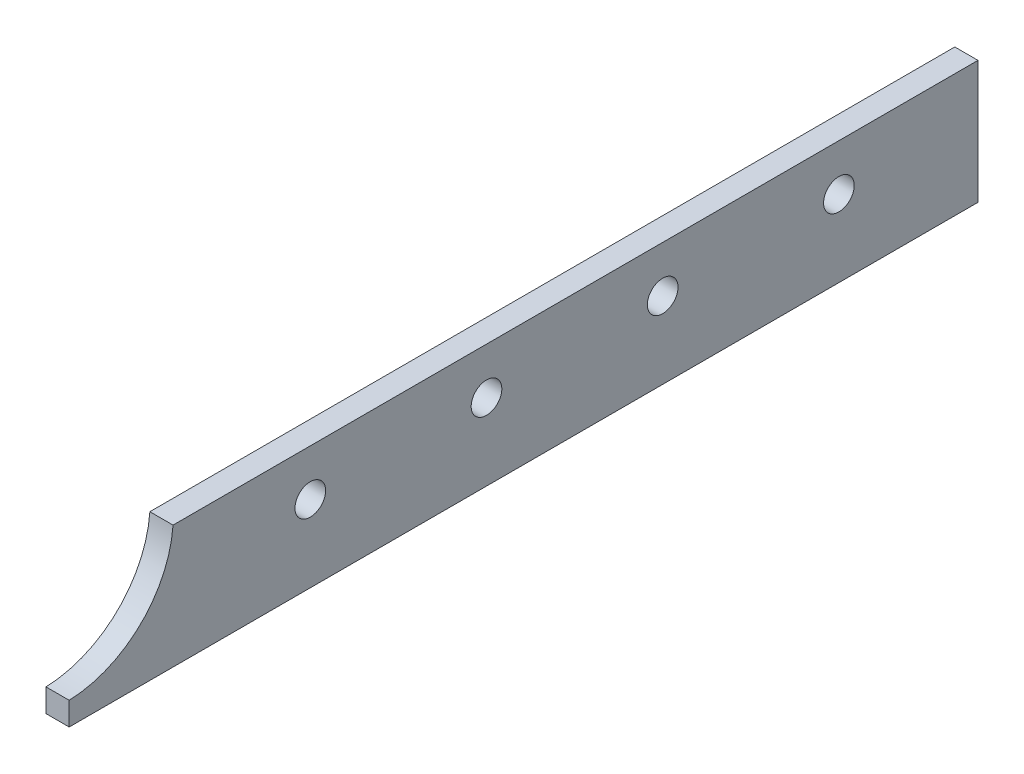
ISO-10303-21;
HEADER;
FILE_DESCRIPTION(('STEP AP214'),'2;1');
FILE_NAME('part.step','',(''),(''),'','','');
FILE_SCHEMA(('AUTOMOTIVE_DESIGN { 1 0 10303 214 1 1 1 1 }'));
ENDSEC;
DATA;
#1=APPLICATION_CONTEXT('core data for automotive mechanical design processes');
#2=APPLICATION_PROTOCOL_DEFINITION('international standard','automotive_design',2000,#1);
#3=PRODUCT_CONTEXT('',#1,'mechanical');
#4=PRODUCT('Part','Part','',(#3));
#5=PRODUCT_RELATED_PRODUCT_CATEGORY('part','',(#4));
#6=PRODUCT_DEFINITION_FORMATION('','',#4);
#7=PRODUCT_DEFINITION_CONTEXT('part definition',#1,'design');
#8=PRODUCT_DEFINITION('design','',#6,#7);
#9=PRODUCT_DEFINITION_SHAPE('','',#8);
#10=(LENGTH_UNIT() NAMED_UNIT(*) SI_UNIT(.MILLI.,.METRE.));
#11=(NAMED_UNIT(*) PLANE_ANGLE_UNIT() SI_UNIT($,.RADIAN.));
#12=(NAMED_UNIT(*) SI_UNIT($,.STERADIAN.) SOLID_ANGLE_UNIT());
#13=UNCERTAINTY_MEASURE_WITH_UNIT(LENGTH_MEASURE(1.E-05),#10,'distance_accuracy_value','');
#14=(GEOMETRIC_REPRESENTATION_CONTEXT(3) GLOBAL_UNCERTAINTY_ASSIGNED_CONTEXT((#13)) GLOBAL_UNIT_ASSIGNED_CONTEXT((#10,
#11,#12)) REPRESENTATION_CONTEXT('',''));
#15=CARTESIAN_POINT('',(0.,0.,0.));
#16=DIRECTION('',(0.,0.,1.));
#17=DIRECTION('',(1.,0.,0.));
#18=AXIS2_PLACEMENT_3D('',#15,#16,#17);
#19=CARTESIAN_POINT('',(3.175,-8.4201,-62.23));
#20=DIRECTION('',(0.,0.,1.));
#21=DIRECTION('',(1.,0.,0.));
#22=AXIS2_PLACEMENT_3D('',#19,#20,#21);
#23=PLANE('',#22);
#24=DIRECTION('',(0.,1.,0.));
#25=VECTOR('',#24,1.);
#26=CARTESIAN_POINT('',(0.,-8.4201,-62.23));
#27=LINE('',#26,#25);
#28=CARTESIAN_POINT('',(0.,-8.4201,-62.23));
#29=VERTEX_POINT('',#28);
#30=CARTESIAN_POINT('',(0.,8.4201,-62.23));
#31=VERTEX_POINT('',#30);
#32=EDGE_CURVE('E113',#29,#31,#27,.T.);
#33=ORIENTED_EDGE('',*,*,#32,.T.);
#34=DIRECTION('',(-1.,0.,0.));
#35=VECTOR('',#34,1.);
#36=CARTESIAN_POINT('',(3.175,8.4201,-62.23));
#37=LINE('',#36,#35);
#38=CARTESIAN_POINT('',(3.175,8.4201,-62.23));
#39=VERTEX_POINT('',#38);
#40=EDGE_CURVE('E11',#39,#31,#37,.T.);
#41=ORIENTED_EDGE('',*,*,#40,.F.);
#42=DIRECTION('',(0.,1.,0.));
#43=VECTOR('',#42,1.);
#44=CARTESIAN_POINT('',(3.175,-8.4201,-62.23));
#45=LINE('',#44,#43);
#46=CARTESIAN_POINT('',(3.175,-8.4201,-62.23));
#47=VERTEX_POINT('',#46);
#48=EDGE_CURVE('E122',#47,#39,#45,.T.);
#49=ORIENTED_EDGE('',*,*,#48,.F.);
#50=DIRECTION('',(-1.,0.,0.));
#51=VECTOR('',#50,1.);
#52=CARTESIAN_POINT('',(3.175,-8.4201,-62.23));
#53=LINE('',#52,#51);
#54=EDGE_CURVE('E109',#47,#29,#53,.T.);
#55=ORIENTED_EDGE('',*,*,#54,.T.);
#56=EDGE_LOOP('',(#33,#41,#49,#55));
#57=FACE_BOUND('',#56,.T.);
#58=ADVANCED_FACE('F39',(#57),#23,.F.);
#59=CARTESIAN_POINT('',(3.175,8.4201,48.006));
#60=DIRECTION('',(0.,-1.,0.));
#61=DIRECTION('',(0.,0.,-1.));
#62=AXIS2_PLACEMENT_3D('',#59,#60,#61);
#63=PLANE('',#62);
#64=DIRECTION('',(0.,0.,1.));
#65=VECTOR('',#64,1.);
#66=CARTESIAN_POINT('',(0.,8.4201,48.006));
#67=LINE('',#66,#65);
#68=CARTESIAN_POINT('',(0.,8.4201,48.006));
#69=VERTEX_POINT('',#68);
#70=EDGE_CURVE('E116',#31,#69,#67,.T.);
#71=ORIENTED_EDGE('',*,*,#70,.T.);
#72=DIRECTION('',(-1.,0.,0.));
#73=VECTOR('',#72,1.);
#74=CARTESIAN_POINT('',(3.175,8.4201,48.006));
#75=LINE('',#74,#73);
#76=CARTESIAN_POINT('',(3.175,8.4201,48.006));
#77=VERTEX_POINT('',#76);
#78=EDGE_CURVE('E47',#77,#69,#75,.T.);
#79=ORIENTED_EDGE('',*,*,#78,.F.);
#80=DIRECTION('',(0.,0.,1.));
#81=VECTOR('',#80,1.);
#82=CARTESIAN_POINT('',(3.175,8.4201,48.006));
#83=LINE('',#82,#81);
#84=EDGE_CURVE('E89',#39,#77,#83,.T.);
#85=ORIENTED_EDGE('',*,*,#84,.F.);
#86=ORIENTED_EDGE('',*,*,#40,.T.);
#87=EDGE_LOOP('',(#71,#79,#85,#86));
#88=FACE_BOUND('',#87,.T.);
#89=ADVANCED_FACE('F142',(#88),#63,.F.);
#90=CARTESIAN_POINT('',(3.175,9.47940508449197,62.6998659561727));
#91=DIRECTION('',(-1.,0.,0.));
#92=DIRECTION('',(0.,0.,1.));
#93=AXIS2_PLACEMENT_3D('',#90,#91,#92);
#94=CYLINDRICAL_SURFACE('',#93,14.732);
#95=CARTESIAN_POINT('',(0.,9.47940508449197,62.6998659561727));
#96=DIRECTION('',(-1.,0.,0.));
#97=DIRECTION('',(0.,0.,-1.));
#98=AXIS2_PLACEMENT_3D('',#95,#96,#97);
#99=CIRCLE('',#98,14.732);
#100=CARTESIAN_POINT('',(0.,-5.2451,62.23));
#101=VERTEX_POINT('',#100);
#102=EDGE_CURVE('E104',#69,#101,#99,.T.);
#103=ORIENTED_EDGE('',*,*,#102,.T.);
#104=DIRECTION('',(-1.,0.,0.));
#105=VECTOR('',#104,1.);
#106=CARTESIAN_POINT('',(3.175,-5.2451,62.23));
#107=LINE('',#106,#105);
#108=CARTESIAN_POINT('',(3.175,-5.2451,62.23));
#109=VERTEX_POINT('',#108);
#110=EDGE_CURVE('E101',#109,#101,#107,.T.);
#111=ORIENTED_EDGE('',*,*,#110,.F.);
#112=CARTESIAN_POINT('',(3.175,9.47940508449197,62.6998659561727));
#113=DIRECTION('',(-1.,0.,0.));
#114=DIRECTION('',(0.,0.,-1.));
#115=AXIS2_PLACEMENT_3D('',#112,#113,#114);
#116=CIRCLE('',#115,14.732);
#117=EDGE_CURVE('E93',#77,#109,#116,.T.);
#118=ORIENTED_EDGE('',*,*,#117,.F.);
#119=ORIENTED_EDGE('',*,*,#78,.T.);
#120=EDGE_LOOP('',(#103,#111,#118,#119));
#121=FACE_BOUND('',#120,.T.);
#122=ADVANCED_FACE('F102',(#121),#94,.F.);
#123=CARTESIAN_POINT('',(3.175,-8.4201,62.23));
#124=DIRECTION('',(0.,0.,-1.));
#125=DIRECTION('',(0.,1.,0.));
#126=AXIS2_PLACEMENT_3D('',#123,#124,#125);
#127=PLANE('',#126);
#128=DIRECTION('',(0.,-1.,0.));
#129=VECTOR('',#128,1.);
#130=CARTESIAN_POINT('',(0.,-8.4201,62.23));
#131=LINE('',#130,#129);
#132=CARTESIAN_POINT('',(0.,-8.4201,62.23));
#133=VERTEX_POINT('',#132);
#134=EDGE_CURVE('E75',#101,#133,#131,.T.);
#135=ORIENTED_EDGE('',*,*,#134,.T.);
#136=DIRECTION('',(-1.,0.,0.));
#137=VECTOR('',#136,1.);
#138=CARTESIAN_POINT('',(3.175,-8.4201,62.23));
#139=LINE('',#138,#137);
#140=CARTESIAN_POINT('',(3.175,-8.4201,62.23));
#141=VERTEX_POINT('',#140);
#142=EDGE_CURVE('E105',#141,#133,#139,.T.);
#143=ORIENTED_EDGE('',*,*,#142,.F.);
#144=DIRECTION('',(0.,-1.,0.));
#145=VECTOR('',#144,1.);
#146=CARTESIAN_POINT('',(3.175,-8.4201,62.23));
#147=LINE('',#146,#145);
#148=EDGE_CURVE('E97',#109,#141,#147,.T.);
#149=ORIENTED_EDGE('',*,*,#148,.F.);
#150=ORIENTED_EDGE('',*,*,#110,.T.);
#151=EDGE_LOOP('',(#135,#143,#149,#150));
#152=FACE_BOUND('',#151,.T.);
#153=ADVANCED_FACE('F107',(#152),#127,.F.);
#154=CARTESIAN_POINT('',(3.175,-8.4201,62.23));
#155=DIRECTION('',(0.,1.,0.));
#156=DIRECTION('',(0.,0.,1.));
#157=AXIS2_PLACEMENT_3D('',#154,#155,#156);
#158=PLANE('',#157);
#159=DIRECTION('',(0.,0.,-1.));
#160=VECTOR('',#159,1.);
#161=CARTESIAN_POINT('',(0.,-8.4201,62.23));
#162=LINE('',#161,#160);
#163=EDGE_CURVE('E81',#133,#29,#162,.T.);
#164=ORIENTED_EDGE('',*,*,#163,.T.);
#165=ORIENTED_EDGE('',*,*,#54,.F.);
#166=DIRECTION('',(0.,0.,-1.));
#167=VECTOR('',#166,1.);
#168=CARTESIAN_POINT('',(3.175,-8.4201,62.23));
#169=LINE('',#168,#167);
#170=EDGE_CURVE('E55',#141,#47,#169,.T.);
#171=ORIENTED_EDGE('',*,*,#170,.F.);
#172=ORIENTED_EDGE('',*,*,#142,.T.);
#173=EDGE_LOOP('',(#164,#165,#171,#172));
#174=FACE_BOUND('',#173,.T.);
#175=ADVANCED_FACE('F130',(#174),#158,.F.);
#176=CARTESIAN_POINT('',(3.175,9.47940508449197,62.6998659561727));
#177=DIRECTION('',(1.,0.,0.));
#178=DIRECTION('',(0.,0.,-1.));
#179=AXIS2_PLACEMENT_3D('',#176,#177,#178);
#180=PLANE('',#179);
#181=CARTESIAN_POINT('',(3.175,2.0701,-43.18));
#182=DIRECTION('',(-1.,0.,0.));
#183=DIRECTION('',(0.,0.,1.));
#184=AXIS2_PLACEMENT_3D('',#181,#182,#183);
#185=CIRCLE('',#184,2.1);
#186=CARTESIAN_POINT('',(3.175,2.0701,-41.08));
#187=VERTEX_POINT('',#186);
#188=EDGE_CURVE('E117',#187,#187,#185,.T.);
#189=ORIENTED_EDGE('',*,*,#188,.T.);
#190=EDGE_LOOP('',(#189));
#191=FACE_BOUND('',#190,.T.);
#192=CARTESIAN_POINT('',(3.175,2.0701,-19.05));
#193=DIRECTION('',(-1.,0.,0.));
#194=DIRECTION('',(0.,0.,1.));
#195=AXIS2_PLACEMENT_3D('',#192,#193,#194);
#196=CIRCLE('',#195,2.1);
#197=CARTESIAN_POINT('',(3.175,2.0701,-16.95));
#198=VERTEX_POINT('',#197);
#199=EDGE_CURVE('E229',#198,#198,#196,.T.);
#200=ORIENTED_EDGE('',*,*,#199,.T.);
#201=EDGE_LOOP('',(#200));
#202=FACE_BOUND('',#201,.T.);
#203=CARTESIAN_POINT('',(3.175,2.0701,5.08000000000002));
#204=DIRECTION('',(-1.,0.,0.));
#205=DIRECTION('',(0.,0.,1.));
#206=AXIS2_PLACEMENT_3D('',#203,#204,#205);
#207=CIRCLE('',#206,2.1);
#208=CARTESIAN_POINT('',(3.175,2.0701,7.18000000000002));
#209=VERTEX_POINT('',#208);
#210=EDGE_CURVE('E237',#209,#209,#207,.T.);
#211=ORIENTED_EDGE('',*,*,#210,.T.);
#212=EDGE_LOOP('',(#211));
#213=FACE_BOUND('',#212,.T.);
#214=CARTESIAN_POINT('',(3.175,2.0701,29.21));
#215=DIRECTION('',(-1.,0.,0.));
#216=DIRECTION('',(0.,0.,1.));
#217=AXIS2_PLACEMENT_3D('',#214,#215,#216);
#218=CIRCLE('',#217,2.1);
#219=CARTESIAN_POINT('',(3.175,2.0701,31.31));
#220=VERTEX_POINT('',#219);
#221=EDGE_CURVE('E243',#220,#220,#218,.T.);
#222=ORIENTED_EDGE('',*,*,#221,.T.);
#223=EDGE_LOOP('',(#222));
#224=FACE_BOUND('',#223,.T.);
#225=ORIENTED_EDGE('',*,*,#48,.T.);
#226=ORIENTED_EDGE('',*,*,#84,.T.);
#227=ORIENTED_EDGE('',*,*,#117,.T.);
#228=ORIENTED_EDGE('',*,*,#148,.T.);
#229=ORIENTED_EDGE('',*,*,#170,.T.);
#230=EDGE_LOOP('',(#225,#226,#227,#228,#229));
#231=FACE_BOUND('',#230,.T.);
#232=ADVANCED_FACE('F95',(#191,#202,#213,#224,#231),#180,.T.);
#233=CARTESIAN_POINT('',(0.,9.47940508449197,62.6998659561727));
#234=DIRECTION('',(1.,0.,0.));
#235=DIRECTION('',(0.,0.,-1.));
#236=AXIS2_PLACEMENT_3D('',#233,#234,#235);
#237=PLANE('',#236);
#238=CARTESIAN_POINT('',(0.,2.0701,-43.18));
#239=DIRECTION('',(-1.,0.,0.));
#240=DIRECTION('',(0.,0.,1.));
#241=AXIS2_PLACEMENT_3D('',#238,#239,#240);
#242=CIRCLE('',#241,2.1);
#243=CARTESIAN_POINT('',(0.,2.0701,-41.08));
#244=VERTEX_POINT('',#243);
#245=EDGE_CURVE('E224',#244,#244,#242,.T.);
#246=ORIENTED_EDGE('',*,*,#245,.F.);
#247=EDGE_LOOP('',(#246));
#248=FACE_BOUND('',#247,.T.);
#249=CARTESIAN_POINT('',(0.,2.0701,-19.05));
#250=DIRECTION('',(-1.,0.,0.));
#251=DIRECTION('',(0.,0.,1.));
#252=AXIS2_PLACEMENT_3D('',#249,#250,#251);
#253=CIRCLE('',#252,2.1);
#254=CARTESIAN_POINT('',(0.,2.0701,-16.95));
#255=VERTEX_POINT('',#254);
#256=EDGE_CURVE('E225',#255,#255,#253,.T.);
#257=ORIENTED_EDGE('',*,*,#256,.F.);
#258=EDGE_LOOP('',(#257));
#259=FACE_BOUND('',#258,.T.);
#260=CARTESIAN_POINT('',(0.,2.0701,5.08000000000002));
#261=DIRECTION('',(-1.,0.,0.));
#262=DIRECTION('',(0.,0.,1.));
#263=AXIS2_PLACEMENT_3D('',#260,#261,#262);
#264=CIRCLE('',#263,2.1);
#265=CARTESIAN_POINT('',(0.,2.0701,7.18000000000002));
#266=VERTEX_POINT('',#265);
#267=EDGE_CURVE('E234',#266,#266,#264,.T.);
#268=ORIENTED_EDGE('',*,*,#267,.F.);
#269=EDGE_LOOP('',(#268));
#270=FACE_BOUND('',#269,.T.);
#271=CARTESIAN_POINT('',(0.,2.0701,29.21));
#272=DIRECTION('',(-1.,0.,0.));
#273=DIRECTION('',(0.,0.,1.));
#274=AXIS2_PLACEMENT_3D('',#271,#272,#273);
#275=CIRCLE('',#274,2.1);
#276=CARTESIAN_POINT('',(0.,2.0701,31.31));
#277=VERTEX_POINT('',#276);
#278=EDGE_CURVE('E240',#277,#277,#275,.T.);
#279=ORIENTED_EDGE('',*,*,#278,.F.);
#280=EDGE_LOOP('',(#279));
#281=FACE_BOUND('',#280,.T.);
#282=ORIENTED_EDGE('',*,*,#32,.F.);
#283=ORIENTED_EDGE('',*,*,#163,.F.);
#284=ORIENTED_EDGE('',*,*,#134,.F.);
#285=ORIENTED_EDGE('',*,*,#102,.F.);
#286=ORIENTED_EDGE('',*,*,#70,.F.);
#287=EDGE_LOOP('',(#282,#283,#284,#285,#286));
#288=FACE_BOUND('',#287,.T.);
#289=ADVANCED_FACE('F126',(#248,#259,#270,#281,#288),#237,.F.);
#290=CARTESIAN_POINT('',(3.175,2.0701,29.21));
#291=DIRECTION('',(-1.,0.,0.));
#292=DIRECTION('',(0.,0.,1.));
#293=AXIS2_PLACEMENT_3D('',#290,#291,#292);
#294=CYLINDRICAL_SURFACE('',#293,2.1);
#295=ORIENTED_EDGE('',*,*,#221,.F.);
#296=EDGE_LOOP('',(#295));
#297=FACE_BOUND('',#296,.T.);
#298=ORIENTED_EDGE('',*,*,#278,.T.);
#299=EDGE_LOOP('',(#298));
#300=FACE_BOUND('',#299,.T.);
#301=ADVANCED_FACE('F177',(#297,#300),#294,.F.);
#302=CARTESIAN_POINT('',(3.175,2.0701,5.08000000000002));
#303=DIRECTION('',(-1.,0.,0.));
#304=DIRECTION('',(0.,0.,1.));
#305=AXIS2_PLACEMENT_3D('',#302,#303,#304);
#306=CYLINDRICAL_SURFACE('',#305,2.1);
#307=ORIENTED_EDGE('',*,*,#210,.F.);
#308=EDGE_LOOP('',(#307));
#309=FACE_BOUND('',#308,.T.);
#310=ORIENTED_EDGE('',*,*,#267,.T.);
#311=EDGE_LOOP('',(#310));
#312=FACE_BOUND('',#311,.T.);
#313=ADVANCED_FACE('F186',(#309,#312),#306,.F.);
#314=CARTESIAN_POINT('',(3.175,2.0701,-19.05));
#315=DIRECTION('',(-1.,0.,0.));
#316=DIRECTION('',(0.,0.,1.));
#317=AXIS2_PLACEMENT_3D('',#314,#315,#316);
#318=CYLINDRICAL_SURFACE('',#317,2.1);
#319=ORIENTED_EDGE('',*,*,#199,.F.);
#320=EDGE_LOOP('',(#319));
#321=FACE_BOUND('',#320,.T.);
#322=ORIENTED_EDGE('',*,*,#256,.T.);
#323=EDGE_LOOP('',(#322));
#324=FACE_BOUND('',#323,.T.);
#325=ADVANCED_FACE('F196',(#321,#324),#318,.F.);
#326=CARTESIAN_POINT('',(3.175,2.0701,-43.18));
#327=DIRECTION('',(-1.,0.,0.));
#328=DIRECTION('',(0.,0.,1.));
#329=AXIS2_PLACEMENT_3D('',#326,#327,#328);
#330=CYLINDRICAL_SURFACE('',#329,2.1);
#331=ORIENTED_EDGE('',*,*,#188,.F.);
#332=EDGE_LOOP('',(#331));
#333=FACE_BOUND('',#332,.T.);
#334=ORIENTED_EDGE('',*,*,#245,.T.);
#335=EDGE_LOOP('',(#334));
#336=FACE_BOUND('',#335,.T.);
#337=ADVANCED_FACE('F206',(#333,#336),#330,.F.);
#338=CLOSED_SHELL('',(#58,#89,#122,#153,#175,#232,#289,#301,#313,#325,#337));
#339=MANIFOLD_SOLID_BREP('B2',#338);
#340=ADVANCED_BREP_SHAPE_REPRESENTATION('',(#18,#339),#14);
#341=SHAPE_DEFINITION_REPRESENTATION(#9,#340);
ENDSEC;
END-ISO-10303-21;
